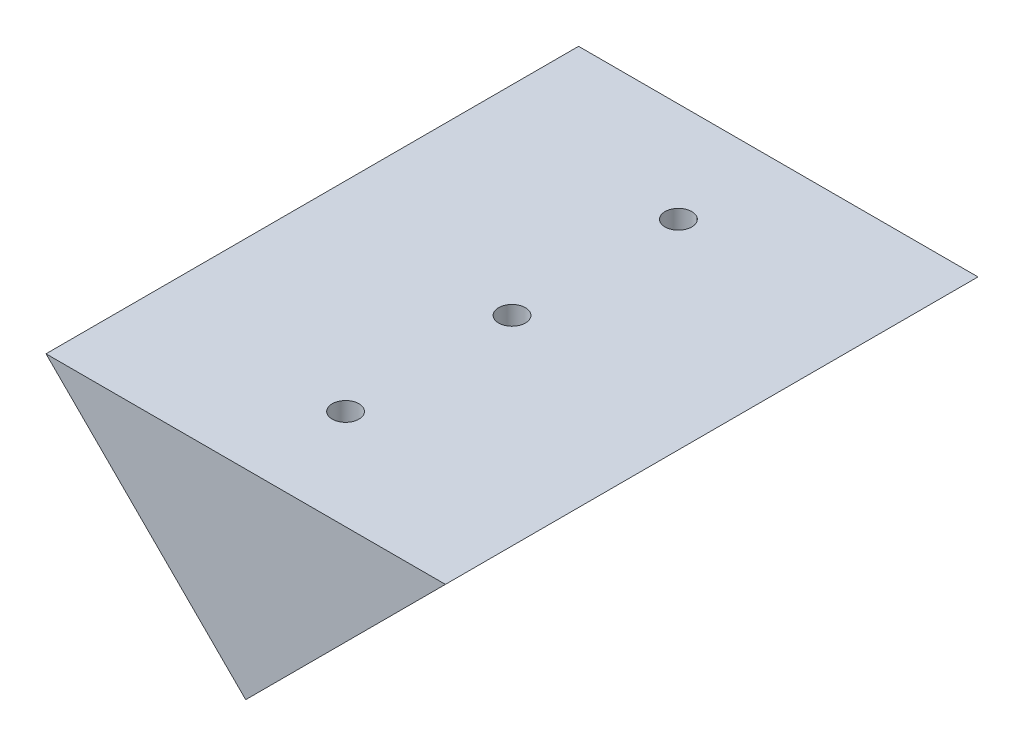
ISO-10303-21;
HEADER;
FILE_DESCRIPTION(('STEP AP214'),'2;1');
FILE_NAME('part.step','',(''),(''),'','','');
FILE_SCHEMA(('AUTOMOTIVE_DESIGN { 1 0 10303 214 1 1 1 1 }'));
ENDSEC;
DATA;
#1=APPLICATION_CONTEXT('core data for automotive mechanical design processes');
#2=APPLICATION_PROTOCOL_DEFINITION('international standard','automotive_design',2000,#1);
#3=PRODUCT_CONTEXT('',#1,'mechanical');
#4=PRODUCT('Part','Part','',(#3));
#5=PRODUCT_RELATED_PRODUCT_CATEGORY('part','',(#4));
#6=PRODUCT_DEFINITION_FORMATION('','',#4);
#7=PRODUCT_DEFINITION_CONTEXT('part definition',#1,'design');
#8=PRODUCT_DEFINITION('design','',#6,#7);
#9=PRODUCT_DEFINITION_SHAPE('','',#8);
#10=(LENGTH_UNIT() NAMED_UNIT(*) SI_UNIT(.MILLI.,.METRE.));
#11=(NAMED_UNIT(*) PLANE_ANGLE_UNIT() SI_UNIT($,.RADIAN.));
#12=(NAMED_UNIT(*) SI_UNIT($,.STERADIAN.) SOLID_ANGLE_UNIT());
#13=UNCERTAINTY_MEASURE_WITH_UNIT(LENGTH_MEASURE(1.E-05),#10,'distance_accuracy_value','');
#14=(GEOMETRIC_REPRESENTATION_CONTEXT(3) GLOBAL_UNCERTAINTY_ASSIGNED_CONTEXT((#13)) GLOBAL_UNIT_ASSIGNED_CONTEXT((#10,
#11,#12)) REPRESENTATION_CONTEXT('',''));
#15=CARTESIAN_POINT('',(0.,0.,0.));
#16=DIRECTION('',(0.,0.,1.));
#17=DIRECTION('',(1.,0.,0.));
#18=AXIS2_PLACEMENT_3D('',#15,#16,#17);
#19=CARTESIAN_POINT('',(-53.3692236261453,-12.7,101.6));
#20=DIRECTION('',(-0.707106781186548,0.707106781186548,0.));
#21=DIRECTION('',(-0.707106781186548,-0.707106781186548,0.));
#22=AXIS2_PLACEMENT_3D('',#19,#20,#21);
#23=PLANE('',#22);
#24=CARTESIAN_POINT('',(-35.408711384007,5.26051224213831,12.7));
#25=DIRECTION('',(0.707106781186548,-0.707106781186547,0.));
#26=DIRECTION('',(0.707106781186547,0.707106781186548,0.));
#27=AXIS2_PLACEMENT_3D('',#24,#25,#26);
#28=CIRCLE('',#27,2.55269999999999);
#29=CARTESIAN_POINT('',(-33.6036799036721,7.0655437224732,12.7));
#30=VERTEX_POINT('',#29);
#31=EDGE_CURVE('E117',#30,#30,#28,.T.);
#32=ORIENTED_EDGE('',*,*,#31,.F.);
#33=EDGE_LOOP('',(#32));
#34=FACE_BOUND('',#33,.T.);
#35=CARTESIAN_POINT('',(-35.408711384007,5.26051224213831,88.9));
#36=DIRECTION('',(0.707106781186548,-0.707106781186547,0.));
#37=DIRECTION('',(0.707106781186547,0.707106781186548,0.));
#38=AXIS2_PLACEMENT_3D('',#35,#36,#37);
#39=CIRCLE('',#38,2.55269999999999);
#40=CARTESIAN_POINT('',(-33.6036799036721,7.0655437224732,88.9));
#41=VERTEX_POINT('',#40);
#42=EDGE_CURVE('E123',#41,#41,#39,.T.);
#43=ORIENTED_EDGE('',*,*,#42,.F.);
#44=EDGE_LOOP('',(#43));
#45=FACE_BOUND('',#44,.T.);
#46=DIRECTION('',(0.707106781186547,0.707106781186547,0.));
#47=VECTOR('',#46,1.);
#48=CARTESIAN_POINT('',(-53.3692236261453,-12.7,0.));
#49=LINE('',#48,#47);
#50=CARTESIAN_POINT('',(-53.3692236261453,-12.7,0.));
#51=VERTEX_POINT('',#50);
#52=CARTESIAN_POINT('',(-15.2692236261453,25.4,0.));
#53=VERTEX_POINT('',#52);
#54=EDGE_CURVE('E147',#51,#53,#49,.T.);
#55=ORIENTED_EDGE('',*,*,#54,.T.);
#56=DIRECTION('',(0.,0.,-1.));
#57=VECTOR('',#56,1.);
#58=CARTESIAN_POINT('',(-15.2692236261453,25.4,101.6));
#59=LINE('',#58,#57);
#60=CARTESIAN_POINT('',(-15.2692236261453,25.4,101.6));
#61=VERTEX_POINT('',#60);
#62=EDGE_CURVE('E11',#61,#53,#59,.T.);
#63=ORIENTED_EDGE('',*,*,#62,.F.);
#64=DIRECTION('',(0.707106781186547,0.707106781186547,0.));
#65=VECTOR('',#64,1.);
#66=CARTESIAN_POINT('',(-53.3692236261453,-12.7,101.6));
#67=LINE('',#66,#65);
#68=CARTESIAN_POINT('',(-53.3692236261453,-12.7,101.6));
#69=VERTEX_POINT('',#68);
#70=EDGE_CURVE('E148',#69,#61,#67,.T.);
#71=ORIENTED_EDGE('',*,*,#70,.F.);
#72=DIRECTION('',(0.,0.,-1.));
#73=VECTOR('',#72,1.);
#74=CARTESIAN_POINT('',(-53.3692236261453,-12.7,101.6));
#75=LINE('',#74,#73);
#76=EDGE_CURVE('E152',#69,#51,#75,.T.);
#77=ORIENTED_EDGE('',*,*,#76,.T.);
#78=EDGE_LOOP('',(#55,#63,#71,#77));
#79=FACE_BOUND('',#78,.T.);
#80=ADVANCED_FACE('F37',(#34,#45,#79),#23,.F.);
#81=CARTESIAN_POINT('',(-91.4692236261453,25.4,101.6));
#82=DIRECTION('',(0.,-1.,0.));
#83=DIRECTION('',(0.,0.,-1.));
#84=AXIS2_PLACEMENT_3D('',#81,#82,#83);
#85=PLANE('',#84);
#86=CARTESIAN_POINT('',(-53.3692236261453,25.4,19.05));
#87=DIRECTION('',(0.,1.,0.));
#88=DIRECTION('',(0.,0.,1.));
#89=AXIS2_PLACEMENT_3D('',#86,#87,#88);
#90=CIRCLE('',#89,2.5527);
#91=CARTESIAN_POINT('',(-53.3692236261453,25.4,21.6027));
#92=VERTEX_POINT('',#91);
#93=EDGE_CURVE('E129',#92,#92,#90,.T.);
#94=ORIENTED_EDGE('',*,*,#93,.F.);
#95=EDGE_LOOP('',(#94));
#96=FACE_BOUND('',#95,.T.);
#97=CARTESIAN_POINT('',(-53.3692236261453,25.4,82.55));
#98=DIRECTION('',(0.,1.,0.));
#99=DIRECTION('',(0.,0.,1.));
#100=AXIS2_PLACEMENT_3D('',#97,#98,#99);
#101=CIRCLE('',#100,2.5527);
#102=CARTESIAN_POINT('',(-53.3692236261453,25.4,85.1027));
#103=VERTEX_POINT('',#102);
#104=EDGE_CURVE('E135',#103,#103,#101,.T.);
#105=ORIENTED_EDGE('',*,*,#104,.F.);
#106=EDGE_LOOP('',(#105));
#107=FACE_BOUND('',#106,.T.);
#108=CARTESIAN_POINT('',(-53.3692236261453,25.4,50.8));
#109=DIRECTION('',(0.,1.,0.));
#110=DIRECTION('',(0.,0.,1.));
#111=AXIS2_PLACEMENT_3D('',#108,#109,#110);
#112=CIRCLE('',#111,2.5527);
#113=CARTESIAN_POINT('',(-53.3692236261453,25.4,53.3527));
#114=VERTEX_POINT('',#113);
#115=EDGE_CURVE('E141',#114,#114,#112,.T.);
#116=ORIENTED_EDGE('',*,*,#115,.F.);
#117=EDGE_LOOP('',(#116));
#118=FACE_BOUND('',#117,.T.);
#119=DIRECTION('',(-1.,0.,0.));
#120=VECTOR('',#119,1.);
#121=CARTESIAN_POINT('',(-91.4692236261453,25.4,0.));
#122=LINE('',#121,#120);
#123=CARTESIAN_POINT('',(-91.4692236261453,25.4,0.));
#124=VERTEX_POINT('',#123);
#125=EDGE_CURVE('E66',#53,#124,#122,.T.);
#126=ORIENTED_EDGE('',*,*,#125,.T.);
#127=DIRECTION('',(0.,0.,-1.));
#128=VECTOR('',#127,1.);
#129=CARTESIAN_POINT('',(-91.4692236261453,25.4,101.6));
#130=LINE('',#129,#128);
#131=CARTESIAN_POINT('',(-91.4692236261453,25.4,101.6));
#132=VERTEX_POINT('',#131);
#133=EDGE_CURVE('E45',#132,#124,#130,.T.);
#134=ORIENTED_EDGE('',*,*,#133,.F.);
#135=DIRECTION('',(-1.,0.,0.));
#136=VECTOR('',#135,1.);
#137=CARTESIAN_POINT('',(-91.4692236261453,25.4,101.6));
#138=LINE('',#137,#136);
#139=EDGE_CURVE('E74',#61,#132,#138,.T.);
#140=ORIENTED_EDGE('',*,*,#139,.F.);
#141=ORIENTED_EDGE('',*,*,#62,.T.);
#142=EDGE_LOOP('',(#126,#134,#140,#141));
#143=FACE_BOUND('',#142,.T.);
#144=ADVANCED_FACE('F173',(#96,#107,#118,#143),#85,.F.);
#145=CARTESIAN_POINT('',(-91.4692236261453,25.4,101.6));
#146=DIRECTION('',(0.707106781186548,0.707106781186548,0.));
#147=DIRECTION('',(-0.707106781186548,0.707106781186548,0.));
#148=AXIS2_PLACEMENT_3D('',#145,#146,#147);
#149=PLANE('',#148);
#150=CARTESIAN_POINT('',(-71.3297358682836,5.26051224213828,82.55));
#151=DIRECTION('',(-0.707106781186548,-0.707106781186547,0.));
#152=DIRECTION('',(0.707106781186547,-0.707106781186548,0.));
#153=AXIS2_PLACEMENT_3D('',#150,#151,#152);
#154=CIRCLE('',#153,2.55269999999999);
#155=CARTESIAN_POINT('',(-69.5247043879487,3.45548076180339,82.55));
#156=VERTEX_POINT('',#155);
#157=EDGE_CURVE('E107',#156,#156,#154,.T.);
#158=ORIENTED_EDGE('',*,*,#157,.F.);
#159=EDGE_LOOP('',(#158));
#160=FACE_BOUND('',#159,.T.);
#161=CARTESIAN_POINT('',(-71.3297358682836,5.26051224213828,19.05));
#162=DIRECTION('',(-0.707106781186548,-0.707106781186547,0.));
#163=DIRECTION('',(0.707106781186547,-0.707106781186548,0.));
#164=AXIS2_PLACEMENT_3D('',#161,#162,#163);
#165=CIRCLE('',#164,2.55269999999999);
#166=CARTESIAN_POINT('',(-69.5247043879487,3.45548076180338,19.05));
#167=VERTEX_POINT('',#166);
#168=EDGE_CURVE('E106',#167,#167,#165,.T.);
#169=ORIENTED_EDGE('',*,*,#168,.F.);
#170=EDGE_LOOP('',(#169));
#171=FACE_BOUND('',#170,.T.);
#172=DIRECTION('',(0.707106781186547,-0.707106781186547,0.));
#173=VECTOR('',#172,1.);
#174=CARTESIAN_POINT('',(-91.4692236261453,25.4,0.));
#175=LINE('',#174,#173);
#176=EDGE_CURVE('E71',#124,#51,#175,.T.);
#177=ORIENTED_EDGE('',*,*,#176,.T.);
#178=ORIENTED_EDGE('',*,*,#76,.F.);
#179=DIRECTION('',(0.707106781186547,-0.707106781186547,0.));
#180=VECTOR('',#179,1.);
#181=CARTESIAN_POINT('',(-91.4692236261453,25.4,101.6));
#182=LINE('',#181,#180);
#183=EDGE_CURVE('E53',#132,#69,#182,.T.);
#184=ORIENTED_EDGE('',*,*,#183,.F.);
#185=ORIENTED_EDGE('',*,*,#133,.T.);
#186=EDGE_LOOP('',(#177,#178,#184,#185));
#187=FACE_BOUND('',#186,.T.);
#188=ADVANCED_FACE('F157',(#160,#171,#187),#149,.F.);
#189=CARTESIAN_POINT('',(0.,0.,101.6));
#190=DIRECTION('',(0.,0.,-1.));
#191=DIRECTION('',(-1.,0.,0.));
#192=AXIS2_PLACEMENT_3D('',#189,#190,#191);
#193=PLANE('',#192);
#194=ORIENTED_EDGE('',*,*,#70,.T.);
#195=ORIENTED_EDGE('',*,*,#139,.T.);
#196=ORIENTED_EDGE('',*,*,#183,.T.);
#197=EDGE_LOOP('',(#194,#195,#196));
#198=FACE_BOUND('',#197,.T.);
#199=ADVANCED_FACE('F164',(#198),#193,.F.);
#200=CARTESIAN_POINT('',(0.,0.,0.));
#201=DIRECTION('',(0.,0.,-1.));
#202=DIRECTION('',(-1.,0.,0.));
#203=AXIS2_PLACEMENT_3D('',#200,#201,#202);
#204=PLANE('',#203);
#205=ORIENTED_EDGE('',*,*,#54,.F.);
#206=ORIENTED_EDGE('',*,*,#176,.F.);
#207=ORIENTED_EDGE('',*,*,#125,.F.);
#208=EDGE_LOOP('',(#205,#206,#207));
#209=FACE_BOUND('',#208,.T.);
#210=ADVANCED_FACE('F160',(#209),#204,.T.);
#211=CARTESIAN_POINT('',(-53.3692236261453,8.89,50.8));
#212=DIRECTION('',(0.,1.,0.));
#213=DIRECTION('',(0.,0.,1.));
#214=AXIS2_PLACEMENT_3D('',#211,#212,#213);
#215=CONICAL_SURFACE('',#214,2.5527,1.02974425867665);
#216=CARTESIAN_POINT('',(-53.3692236261453,7.35618309780834,50.8));
#217=VERTEX_POINT('',#216);
#218=VERTEX_LOOP('',#217);
#219=FACE_BOUND('',#218,.T.);
#220=CARTESIAN_POINT('',(-53.3692236261453,8.89,50.8));
#221=DIRECTION('',(0.,1.,0.));
#222=DIRECTION('',(0.,0.,1.));
#223=AXIS2_PLACEMENT_3D('',#220,#221,#222);
#224=CIRCLE('',#223,2.5527);
#225=CARTESIAN_POINT('',(-53.3692236261453,8.89,53.3527));
#226=VERTEX_POINT('',#225);
#227=EDGE_CURVE('E144',#226,#226,#224,.T.);
#228=ORIENTED_EDGE('',*,*,#227,.T.);
#229=EDGE_LOOP('',(#228));
#230=FACE_BOUND('',#229,.T.);
#231=ADVANCED_FACE('F171',(#219,#230),#215,.F.);
#232=CARTESIAN_POINT('',(-53.3692236261453,25.4,50.8));
#233=DIRECTION('',(0.,1.,0.));
#234=DIRECTION('',(0.,0.,1.));
#235=AXIS2_PLACEMENT_3D('',#232,#233,#234);
#236=CYLINDRICAL_SURFACE('',#235,2.5527);
#237=ORIENTED_EDGE('',*,*,#227,.F.);
#238=EDGE_LOOP('',(#237));
#239=FACE_BOUND('',#238,.T.);
#240=ORIENTED_EDGE('',*,*,#115,.T.);
#241=EDGE_LOOP('',(#240));
#242=FACE_BOUND('',#241,.T.);
#243=ADVANCED_FACE('F220',(#239,#242),#236,.F.);
#244=CARTESIAN_POINT('',(-53.3692236261453,8.89,82.55));
#245=DIRECTION('',(0.,1.,0.));
#246=DIRECTION('',(0.,0.,1.));
#247=AXIS2_PLACEMENT_3D('',#244,#245,#246);
#248=CONICAL_SURFACE('',#247,2.5527,1.02974425867665);
#249=CARTESIAN_POINT('',(-53.3692236261453,7.35618309780834,82.55));
#250=VERTEX_POINT('',#249);
#251=VERTEX_LOOP('',#250);
#252=FACE_BOUND('',#251,.T.);
#253=CARTESIAN_POINT('',(-53.3692236261453,8.89,82.55));
#254=DIRECTION('',(0.,1.,0.));
#255=DIRECTION('',(0.,0.,1.));
#256=AXIS2_PLACEMENT_3D('',#253,#254,#255);
#257=CIRCLE('',#256,2.5527);
#258=CARTESIAN_POINT('',(-53.3692236261453,8.89,85.1027));
#259=VERTEX_POINT('',#258);
#260=EDGE_CURVE('E138',#259,#259,#257,.T.);
#261=ORIENTED_EDGE('',*,*,#260,.T.);
#262=EDGE_LOOP('',(#261));
#263=FACE_BOUND('',#262,.T.);
#264=ADVANCED_FACE('F216',(#252,#263),#248,.F.);
#265=CARTESIAN_POINT('',(-53.3692236261453,25.4,82.55));
#266=DIRECTION('',(0.,1.,0.));
#267=DIRECTION('',(0.,0.,1.));
#268=AXIS2_PLACEMENT_3D('',#265,#266,#267);
#269=CYLINDRICAL_SURFACE('',#268,2.5527);
#270=ORIENTED_EDGE('',*,*,#260,.F.);
#271=EDGE_LOOP('',(#270));
#272=FACE_BOUND('',#271,.T.);
#273=ORIENTED_EDGE('',*,*,#104,.T.);
#274=EDGE_LOOP('',(#273));
#275=FACE_BOUND('',#274,.T.);
#276=ADVANCED_FACE('F212',(#272,#275),#269,.F.);
#277=CARTESIAN_POINT('',(-53.3692236261453,8.89,19.05));
#278=DIRECTION('',(0.,1.,0.));
#279=DIRECTION('',(0.,0.,1.));
#280=AXIS2_PLACEMENT_3D('',#277,#278,#279);
#281=CONICAL_SURFACE('',#280,2.5527,1.02974425867665);
#282=CARTESIAN_POINT('',(-53.3692236261453,7.35618309780834,19.05));
#283=VERTEX_POINT('',#282);
#284=VERTEX_LOOP('',#283);
#285=FACE_BOUND('',#284,.T.);
#286=CARTESIAN_POINT('',(-53.3692236261453,8.89,19.05));
#287=DIRECTION('',(0.,1.,0.));
#288=DIRECTION('',(0.,0.,1.));
#289=AXIS2_PLACEMENT_3D('',#286,#287,#288);
#290=CIRCLE('',#289,2.5527);
#291=CARTESIAN_POINT('',(-53.3692236261453,8.89,21.6027));
#292=VERTEX_POINT('',#291);
#293=EDGE_CURVE('E132',#292,#292,#290,.T.);
#294=ORIENTED_EDGE('',*,*,#293,.T.);
#295=EDGE_LOOP('',(#294));
#296=FACE_BOUND('',#295,.T.);
#297=ADVANCED_FACE('F208',(#285,#296),#281,.F.);
#298=CARTESIAN_POINT('',(-53.3692236261453,25.4,19.05));
#299=DIRECTION('',(0.,1.,0.));
#300=DIRECTION('',(0.,0.,1.));
#301=AXIS2_PLACEMENT_3D('',#298,#299,#300);
#302=CYLINDRICAL_SURFACE('',#301,2.5527);
#303=ORIENTED_EDGE('',*,*,#293,.F.);
#304=EDGE_LOOP('',(#303));
#305=FACE_BOUND('',#304,.T.);
#306=ORIENTED_EDGE('',*,*,#93,.T.);
#307=EDGE_LOOP('',(#306));
#308=FACE_BOUND('',#307,.T.);
#309=ADVANCED_FACE('F200',(#305,#308),#302,.F.);
#310=CARTESIAN_POINT('',(-44.3889675050762,14.2407683632075,88.9));
#311=DIRECTION('',(0.707106781186548,-0.707106781186547,0.));
#312=DIRECTION('',(0.707106781186547,0.707106781186548,0.));
#313=AXIS2_PLACEMENT_3D('',#310,#311,#312);
#314=CONICAL_SURFACE('',#313,2.55269999999999,1.02974425867665);
#315=CARTESIAN_POINT('',(-45.4735398377144,15.3253406958457,88.9));
#316=VERTEX_POINT('',#315);
#317=VERTEX_LOOP('',#316);
#318=FACE_BOUND('',#317,.T.);
#319=CARTESIAN_POINT('',(-44.3889675050762,14.2407683632075,88.9));
#320=DIRECTION('',(0.707106781186548,-0.707106781186547,0.));
#321=DIRECTION('',(0.707106781186547,0.707106781186548,0.));
#322=AXIS2_PLACEMENT_3D('',#319,#320,#321);
#323=CIRCLE('',#322,2.55269999999999);
#324=CARTESIAN_POINT('',(-42.5839360247413,16.0457998435424,88.9));
#325=VERTEX_POINT('',#324);
#326=EDGE_CURVE('E126',#325,#325,#323,.T.);
#327=ORIENTED_EDGE('',*,*,#326,.T.);
#328=EDGE_LOOP('',(#327));
#329=FACE_BOUND('',#328,.T.);
#330=ADVANCED_FACE('F190',(#318,#329),#314,.F.);
#331=CARTESIAN_POINT('',(-35.408711384007,5.26051224213831,88.9));
#332=DIRECTION('',(0.707106781186548,-0.707106781186547,0.));
#333=DIRECTION('',(0.707106781186547,0.707106781186548,0.));
#334=AXIS2_PLACEMENT_3D('',#331,#332,#333);
#335=CYLINDRICAL_SURFACE('',#334,2.55269999999999);
#336=ORIENTED_EDGE('',*,*,#326,.F.);
#337=EDGE_LOOP('',(#336));
#338=FACE_BOUND('',#337,.T.);
#339=ORIENTED_EDGE('',*,*,#42,.T.);
#340=EDGE_LOOP('',(#339));
#341=FACE_BOUND('',#340,.T.);
#342=ADVANCED_FACE('F187',(#338,#341),#335,.F.);
#343=CARTESIAN_POINT('',(-44.3889675050762,14.2407683632075,12.7));
#344=DIRECTION('',(0.707106781186548,-0.707106781186547,0.));
#345=DIRECTION('',(0.707106781186547,0.707106781186548,0.));
#346=AXIS2_PLACEMENT_3D('',#343,#344,#345);
#347=CONICAL_SURFACE('',#346,2.5527,1.02974425867665);
#348=CARTESIAN_POINT('',(-45.4735398377144,15.3253406958457,12.7));
#349=VERTEX_POINT('',#348);
#350=VERTEX_LOOP('',#349);
#351=FACE_BOUND('',#350,.T.);
#352=CARTESIAN_POINT('',(-44.3889675050762,14.2407683632075,12.7));
#353=DIRECTION('',(0.707106781186548,-0.707106781186547,0.));
#354=DIRECTION('',(0.707106781186547,0.707106781186548,0.));
#355=AXIS2_PLACEMENT_3D('',#352,#353,#354);
#356=CIRCLE('',#355,2.5527);
#357=CARTESIAN_POINT('',(-42.5839360247413,16.0457998435424,12.7));
#358=VERTEX_POINT('',#357);
#359=EDGE_CURVE('E120',#358,#358,#356,.T.);
#360=ORIENTED_EDGE('',*,*,#359,.T.);
#361=EDGE_LOOP('',(#360));
#362=FACE_BOUND('',#361,.T.);
#363=ADVANCED_FACE('F189',(#351,#362),#347,.F.);
#364=CARTESIAN_POINT('',(-35.408711384007,5.26051224213831,12.7));
#365=DIRECTION('',(0.707106781186548,-0.707106781186547,0.));
#366=DIRECTION('',(0.707106781186547,0.707106781186548,0.));
#367=AXIS2_PLACEMENT_3D('',#364,#365,#366);
#368=CYLINDRICAL_SURFACE('',#367,2.55269999999999);
#369=ORIENTED_EDGE('',*,*,#359,.F.);
#370=EDGE_LOOP('',(#369));
#371=FACE_BOUND('',#370,.T.);
#372=ORIENTED_EDGE('',*,*,#31,.T.);
#373=EDGE_LOOP('',(#372));
#374=FACE_BOUND('',#373,.T.);
#375=ADVANCED_FACE('F197',(#371,#374),#368,.F.);
#376=CARTESIAN_POINT('',(-59.6554029108937,16.9348451995282,19.05));
#377=DIRECTION('',(-0.707106781186548,-0.707106781186547,0.));
#378=DIRECTION('',(0.707106781186547,-0.707106781186548,0.));
#379=AXIS2_PLACEMENT_3D('',#376,#377,#378);
#380=CONICAL_SURFACE('',#379,2.5527,1.02974425867665);
#381=CARTESIAN_POINT('',(-58.5708305782554,18.0194175321664,19.05));
#382=VERTEX_POINT('',#381);
#383=VERTEX_LOOP('',#382);
#384=FACE_BOUND('',#383,.T.);
#385=CARTESIAN_POINT('',(-59.6554029108937,16.9348451995282,19.05));
#386=DIRECTION('',(-0.707106781186548,-0.707106781186547,0.));
#387=DIRECTION('',(0.707106781186547,-0.707106781186548,0.));
#388=AXIS2_PLACEMENT_3D('',#385,#386,#387);
#389=CIRCLE('',#388,2.5527);
#390=CARTESIAN_POINT('',(-57.8503714305588,15.1298137191933,19.05));
#391=VERTEX_POINT('',#390);
#392=EDGE_CURVE('E110',#391,#391,#389,.T.);
#393=ORIENTED_EDGE('',*,*,#392,.T.);
#394=EDGE_LOOP('',(#393));
#395=FACE_BOUND('',#394,.T.);
#396=ADVANCED_FACE('F289',(#384,#395),#380,.F.);
#397=CARTESIAN_POINT('',(-71.3297358682836,5.26051224213828,19.05));
#398=DIRECTION('',(-0.707106781186548,-0.707106781186547,0.));
#399=DIRECTION('',(0.707106781186547,-0.707106781186548,0.));
#400=AXIS2_PLACEMENT_3D('',#397,#398,#399);
#401=CYLINDRICAL_SURFACE('',#400,2.55269999999999);
#402=ORIENTED_EDGE('',*,*,#392,.F.);
#403=EDGE_LOOP('',(#402));
#404=FACE_BOUND('',#403,.T.);
#405=ORIENTED_EDGE('',*,*,#168,.T.);
#406=EDGE_LOOP('',(#405));
#407=FACE_BOUND('',#406,.T.);
#408=ADVANCED_FACE('F100',(#404,#407),#401,.F.);
#409=CARTESIAN_POINT('',(-59.6554029108937,16.9348451995282,82.55));
#410=DIRECTION('',(-0.707106781186548,-0.707106781186547,0.));
#411=DIRECTION('',(0.707106781186547,-0.707106781186548,0.));
#412=AXIS2_PLACEMENT_3D('',#409,#410,#411);
#413=CONICAL_SURFACE('',#412,2.55269999999999,1.02974425867665);
#414=CARTESIAN_POINT('',(-58.5708305782554,18.0194175321664,82.55));
#415=VERTEX_POINT('',#414);
#416=VERTEX_LOOP('',#415);
#417=FACE_BOUND('',#416,.T.);
#418=CARTESIAN_POINT('',(-59.6554029108937,16.9348451995282,82.55));
#419=DIRECTION('',(-0.707106781186548,-0.707106781186547,0.));
#420=DIRECTION('',(0.707106781186547,-0.707106781186548,0.));
#421=AXIS2_PLACEMENT_3D('',#418,#419,#420);
#422=CIRCLE('',#421,2.55269999999999);
#423=CARTESIAN_POINT('',(-57.8503714305588,15.1298137191933,82.55));
#424=VERTEX_POINT('',#423);
#425=EDGE_CURVE('E104',#424,#424,#422,.T.);
#426=ORIENTED_EDGE('',*,*,#425,.T.);
#427=EDGE_LOOP('',(#426));
#428=FACE_BOUND('',#427,.T.);
#429=ADVANCED_FACE('F96',(#417,#428),#413,.F.);
#430=CARTESIAN_POINT('',(-71.3297358682836,5.26051224213828,82.55));
#431=DIRECTION('',(-0.707106781186548,-0.707106781186547,0.));
#432=DIRECTION('',(0.707106781186547,-0.707106781186548,0.));
#433=AXIS2_PLACEMENT_3D('',#430,#431,#432);
#434=CYLINDRICAL_SURFACE('',#433,2.55269999999999);
#435=ORIENTED_EDGE('',*,*,#425,.F.);
#436=EDGE_LOOP('',(#435));
#437=FACE_BOUND('',#436,.T.);
#438=ORIENTED_EDGE('',*,*,#157,.T.);
#439=EDGE_LOOP('',(#438));
#440=FACE_BOUND('',#439,.T.);
#441=ADVANCED_FACE('F99',(#437,#440),#434,.F.);
#442=CLOSED_SHELL('',(#80,#144,#188,#199,#210,#231,#243,#264,#276,#297,#309,#330,#342,#363,#375,
#396,#408,#429,#441));
#443=MANIFOLD_SOLID_BREP('B2',#442);
#444=ADVANCED_BREP_SHAPE_REPRESENTATION('',(#18,#443),#14);
#445=SHAPE_DEFINITION_REPRESENTATION(#9,#444);
ENDSEC;
END-ISO-10303-21;
